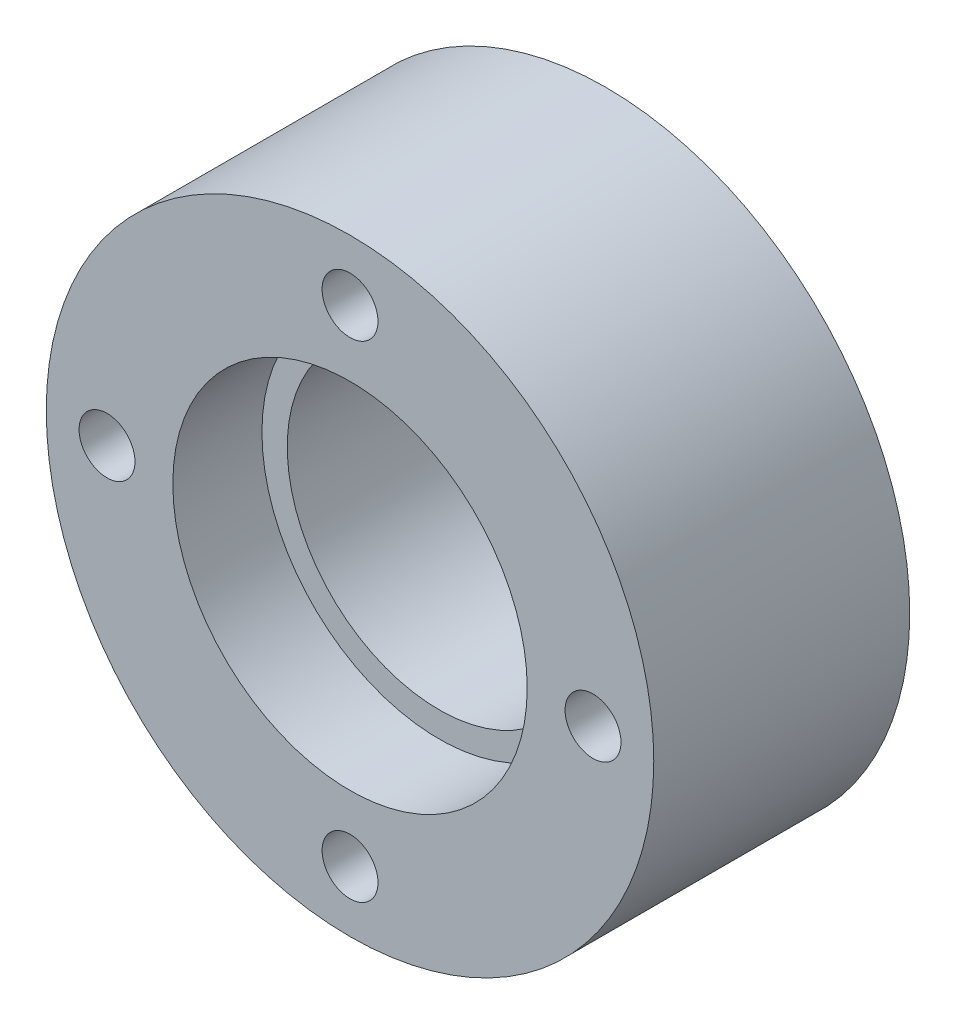
ISO-10303-21;
HEADER;
FILE_DESCRIPTION(('STEP AP214'),'2;1');
FILE_NAME('part.step','',(''),(''),'','','');
FILE_SCHEMA(('AUTOMOTIVE_DESIGN { 1 0 10303 214 1 1 1 1 }'));
ENDSEC;
DATA;
#1=APPLICATION_CONTEXT('core data for automotive mechanical design processes');
#2=APPLICATION_PROTOCOL_DEFINITION('international standard','automotive_design',2000,#1);
#3=PRODUCT_CONTEXT('',#1,'mechanical');
#4=PRODUCT('Part','Part','',(#3));
#5=PRODUCT_RELATED_PRODUCT_CATEGORY('part','',(#4));
#6=PRODUCT_DEFINITION_FORMATION('','',#4);
#7=PRODUCT_DEFINITION_CONTEXT('part definition',#1,'design');
#8=PRODUCT_DEFINITION('design','',#6,#7);
#9=PRODUCT_DEFINITION_SHAPE('','',#8);
#10=(LENGTH_UNIT() NAMED_UNIT(*) SI_UNIT(.MILLI.,.METRE.));
#11=(NAMED_UNIT(*) PLANE_ANGLE_UNIT() SI_UNIT($,.RADIAN.));
#12=(NAMED_UNIT(*) SI_UNIT($,.STERADIAN.) SOLID_ANGLE_UNIT());
#13=UNCERTAINTY_MEASURE_WITH_UNIT(LENGTH_MEASURE(1.E-05),#10,'distance_accuracy_value','');
#14=(GEOMETRIC_REPRESENTATION_CONTEXT(3) GLOBAL_UNCERTAINTY_ASSIGNED_CONTEXT((#13)) GLOBAL_UNIT_ASSIGNED_CONTEXT((#10,
#11,#12)) REPRESENTATION_CONTEXT('',''));
#15=CARTESIAN_POINT('',(0.,0.,0.));
#16=DIRECTION('',(0.,0.,1.));
#17=DIRECTION('',(1.,0.,0.));
#18=AXIS2_PLACEMENT_3D('',#15,#16,#17);
#19=CARTESIAN_POINT('',(0.,0.,16.0528));
#20=DIRECTION('',(0.,0.,-1.));
#21=DIRECTION('',(-1.,0.,0.));
#22=AXIS2_PLACEMENT_3D('',#19,#20,#21);
#23=CYLINDRICAL_SURFACE('',#22,9.525);
#24=CARTESIAN_POINT('',(0.,0.,0.));
#25=DIRECTION('',(0.,0.,1.));
#26=DIRECTION('',(1.,0.,0.));
#27=AXIS2_PLACEMENT_3D('',#24,#25,#26);
#28=CIRCLE('',#27,9.525);
#29=CARTESIAN_POINT('',(9.525,0.,0.));
#30=VERTEX_POINT('',#29);
#31=EDGE_CURVE('E49',#30,#30,#28,.T.);
#32=ORIENTED_EDGE('',*,*,#31,.F.);
#33=EDGE_LOOP('',(#32));
#34=FACE_BOUND('',#33,.T.);
#35=CARTESIAN_POINT('',(0.,0.,10.4648));
#36=DIRECTION('',(0.,0.,1.));
#37=DIRECTION('',(1.,0.,0.));
#38=AXIS2_PLACEMENT_3D('',#35,#36,#37);
#39=CIRCLE('',#38,9.525);
#40=CARTESIAN_POINT('',(9.525,0.,10.4648));
#41=VERTEX_POINT('',#40);
#42=EDGE_CURVE('E40',#41,#41,#39,.T.);
#43=ORIENTED_EDGE('',*,*,#42,.T.);
#44=EDGE_LOOP('',(#43));
#45=FACE_BOUND('',#44,.T.);
#46=ADVANCED_FACE('F36',(#34,#45),#23,.F.);
#47=CARTESIAN_POINT('',(0.,0.,16.0528));
#48=DIRECTION('',(0.,0.,1.));
#49=DIRECTION('',(1.,0.,0.));
#50=AXIS2_PLACEMENT_3D('',#47,#48,#49);
#51=PLANE('',#50);
#52=CARTESIAN_POINT('',(0.,0.,16.0528));
#53=DIRECTION('',(0.,0.,1.));
#54=DIRECTION('',(1.,0.,0.));
#55=AXIS2_PLACEMENT_3D('',#52,#53,#54);
#56=CIRCLE('',#55,11.1125);
#57=CARTESIAN_POINT('',(11.1125,0.,16.0528));
#58=VERTEX_POINT('',#57);
#59=EDGE_CURVE('E77',#58,#58,#56,.T.);
#60=ORIENTED_EDGE('',*,*,#59,.F.);
#61=EDGE_LOOP('',(#60));
#62=FACE_BOUND('',#61,.T.);
#63=CARTESIAN_POINT('',(3.72965547335014E-13,-15.2400000000006,16.0528));
#64=DIRECTION('',(0.,0.,1.));
#65=DIRECTION('',(1.,0.,0.));
#66=AXIS2_PLACEMENT_3D('',#63,#64,#65);
#67=CIRCLE('',#66,1.7526);
#68=CARTESIAN_POINT('',(1.75260000000037,-15.2400000000006,16.0528));
#69=VERTEX_POINT('',#68);
#70=EDGE_CURVE('E63',#69,#69,#67,.T.);
#71=ORIENTED_EDGE('',*,*,#70,.F.);
#72=EDGE_LOOP('',(#71));
#73=FACE_BOUND('',#72,.T.);
#74=CARTESIAN_POINT('',(0.,15.2399999999998,16.0528));
#75=DIRECTION('',(0.,0.,1.));
#76=DIRECTION('',(1.,0.,0.));
#77=AXIS2_PLACEMENT_3D('',#74,#75,#76);
#78=CIRCLE('',#77,1.7526);
#79=CARTESIAN_POINT('',(1.7526,15.2399999999998,16.0528));
#80=VERTEX_POINT('',#79);
#81=EDGE_CURVE('E53',#80,#80,#78,.T.);
#82=ORIENTED_EDGE('',*,*,#81,.F.);
#83=EDGE_LOOP('',(#82));
#84=FACE_BOUND('',#83,.T.);
#85=CARTESIAN_POINT('',(0.,0.,16.0528));
#86=DIRECTION('',(0.,0.,1.));
#87=DIRECTION('',(1.,0.,0.));
#88=AXIS2_PLACEMENT_3D('',#85,#86,#87);
#89=CIRCLE('',#88,19.05);
#90=CARTESIAN_POINT('',(19.05,0.,16.0528));
#91=VERTEX_POINT('',#90);
#92=EDGE_CURVE('E10',#91,#91,#89,.T.);
#93=ORIENTED_EDGE('',*,*,#92,.T.);
#94=EDGE_LOOP('',(#93));
#95=FACE_BOUND('',#94,.T.);
#96=CARTESIAN_POINT('',(15.2400000000004,-1.97758476261356E-13,16.0528));
#97=DIRECTION('',(0.,0.,1.));
#98=DIRECTION('',(1.,0.,0.));
#99=AXIS2_PLACEMENT_3D('',#96,#97,#98);
#100=CIRCLE('',#99,1.7526);
#101=CARTESIAN_POINT('',(16.9926000000004,-1.97758476261356E-13,16.0528));
#102=VERTEX_POINT('',#101);
#103=EDGE_CURVE('E57',#102,#102,#100,.T.);
#104=ORIENTED_EDGE('',*,*,#103,.F.);
#105=EDGE_LOOP('',(#104));
#106=FACE_BOUND('',#105,.T.);
#107=CARTESIAN_POINT('',(-15.24,-5.74193470548323E-13,16.0528));
#108=DIRECTION('',(0.,0.,1.));
#109=DIRECTION('',(1.,0.,0.));
#110=AXIS2_PLACEMENT_3D('',#107,#108,#109);
#111=CIRCLE('',#110,1.7526);
#112=CARTESIAN_POINT('',(-13.4874,-5.74193470548323E-13,16.0528));
#113=VERTEX_POINT('',#112);
#114=EDGE_CURVE('E69',#113,#113,#111,.T.);
#115=ORIENTED_EDGE('',*,*,#114,.F.);
#116=EDGE_LOOP('',(#115));
#117=FACE_BOUND('',#116,.T.);
#118=ADVANCED_FACE('F99',(#62,#73,#84,#95,#106,#117),#51,.T.);
#119=CARTESIAN_POINT('',(0.,0.,0.));
#120=DIRECTION('',(0.,0.,1.));
#121=DIRECTION('',(1.,0.,0.));
#122=AXIS2_PLACEMENT_3D('',#119,#120,#121);
#123=PLANE('',#122);
#124=CARTESIAN_POINT('',(0.,0.,0.));
#125=DIRECTION('',(0.,0.,1.));
#126=DIRECTION('',(1.,0.,0.));
#127=AXIS2_PLACEMENT_3D('',#124,#125,#126);
#128=CIRCLE('',#127,19.05);
#129=CARTESIAN_POINT('',(19.05,0.,0.));
#130=VERTEX_POINT('',#129);
#131=EDGE_CURVE('E44',#130,#130,#128,.T.);
#132=ORIENTED_EDGE('',*,*,#131,.F.);
#133=EDGE_LOOP('',(#132));
#134=FACE_BOUND('',#133,.T.);
#135=ORIENTED_EDGE('',*,*,#31,.T.);
#136=EDGE_LOOP('',(#135));
#137=FACE_BOUND('',#136,.T.);
#138=CARTESIAN_POINT('',(0.,15.2399999999998,0.));
#139=DIRECTION('',(0.,0.,1.));
#140=DIRECTION('',(1.,0.,0.));
#141=AXIS2_PLACEMENT_3D('',#138,#139,#140);
#142=CIRCLE('',#141,1.7526);
#143=CARTESIAN_POINT('',(1.7526,15.2399999999998,0.));
#144=VERTEX_POINT('',#143);
#145=EDGE_CURVE('E54',#144,#144,#142,.T.);
#146=ORIENTED_EDGE('',*,*,#145,.T.);
#147=EDGE_LOOP('',(#146));
#148=FACE_BOUND('',#147,.T.);
#149=CARTESIAN_POINT('',(15.2400000000004,-1.97758476261356E-13,0.));
#150=DIRECTION('',(0.,0.,1.));
#151=DIRECTION('',(1.,0.,0.));
#152=AXIS2_PLACEMENT_3D('',#149,#150,#151);
#153=CIRCLE('',#152,1.7526);
#154=CARTESIAN_POINT('',(16.9926000000004,-1.97758476261356E-13,0.));
#155=VERTEX_POINT('',#154);
#156=EDGE_CURVE('E60',#155,#155,#153,.T.);
#157=ORIENTED_EDGE('',*,*,#156,.T.);
#158=EDGE_LOOP('',(#157));
#159=FACE_BOUND('',#158,.T.);
#160=CARTESIAN_POINT('',(3.72965547335014E-13,-15.2400000000006,0.));
#161=DIRECTION('',(0.,0.,1.));
#162=DIRECTION('',(1.,0.,0.));
#163=AXIS2_PLACEMENT_3D('',#160,#161,#162);
#164=CIRCLE('',#163,1.7526);
#165=CARTESIAN_POINT('',(1.75260000000037,-15.2400000000006,0.));
#166=VERTEX_POINT('',#165);
#167=EDGE_CURVE('E66',#166,#166,#164,.T.);
#168=ORIENTED_EDGE('',*,*,#167,.T.);
#169=EDGE_LOOP('',(#168));
#170=FACE_BOUND('',#169,.T.);
#171=CARTESIAN_POINT('',(-15.24,-5.74193470548323E-13,0.));
#172=DIRECTION('',(0.,0.,1.));
#173=DIRECTION('',(1.,0.,0.));
#174=AXIS2_PLACEMENT_3D('',#171,#172,#173);
#175=CIRCLE('',#174,1.7526);
#176=CARTESIAN_POINT('',(-13.4874,-5.74193470548323E-13,0.));
#177=VERTEX_POINT('',#176);
#178=EDGE_CURVE('E72',#177,#177,#175,.T.);
#179=ORIENTED_EDGE('',*,*,#178,.T.);
#180=EDGE_LOOP('',(#179));
#181=FACE_BOUND('',#180,.T.);
#182=ADVANCED_FACE('F105',(#134,#137,#148,#159,#170,#181),#123,.F.);
#183=CARTESIAN_POINT('',(0.,0.,16.0528));
#184=DIRECTION('',(0.,0.,-1.));
#185=DIRECTION('',(-1.,0.,0.));
#186=AXIS2_PLACEMENT_3D('',#183,#184,#185);
#187=CYLINDRICAL_SURFACE('',#186,19.05);
#188=ORIENTED_EDGE('',*,*,#92,.F.);
#189=EDGE_LOOP('',(#188));
#190=FACE_BOUND('',#189,.T.);
#191=ORIENTED_EDGE('',*,*,#131,.T.);
#192=EDGE_LOOP('',(#191));
#193=FACE_BOUND('',#192,.T.);
#194=ADVANCED_FACE('F38',(#190,#193),#187,.T.);
#195=CARTESIAN_POINT('',(0.,15.2399999999998,16.0528));
#196=DIRECTION('',(0.,0.,-1.));
#197=DIRECTION('',(-1.,0.,0.));
#198=AXIS2_PLACEMENT_3D('',#195,#196,#197);
#199=CYLINDRICAL_SURFACE('',#198,1.7526);
#200=ORIENTED_EDGE('',*,*,#81,.T.);
#201=EDGE_LOOP('',(#200));
#202=FACE_BOUND('',#201,.T.);
#203=ORIENTED_EDGE('',*,*,#145,.F.);
#204=EDGE_LOOP('',(#203));
#205=FACE_BOUND('',#204,.T.);
#206=ADVANCED_FACE('F110',(#202,#205),#199,.F.);
#207=CARTESIAN_POINT('',(15.2400000000004,-1.97758476261356E-13,16.0528));
#208=DIRECTION('',(0.,0.,-1.));
#209=DIRECTION('',(-1.,0.,0.));
#210=AXIS2_PLACEMENT_3D('',#207,#208,#209);
#211=CYLINDRICAL_SURFACE('',#210,1.7526);
#212=ORIENTED_EDGE('',*,*,#103,.T.);
#213=EDGE_LOOP('',(#212));
#214=FACE_BOUND('',#213,.T.);
#215=ORIENTED_EDGE('',*,*,#156,.F.);
#216=EDGE_LOOP('',(#215));
#217=FACE_BOUND('',#216,.T.);
#218=ADVANCED_FACE('F136',(#214,#217),#211,.F.);
#219=CARTESIAN_POINT('',(3.72965547335014E-13,-15.2400000000006,16.0528));
#220=DIRECTION('',(0.,0.,-1.));
#221=DIRECTION('',(-1.,0.,0.));
#222=AXIS2_PLACEMENT_3D('',#219,#220,#221);
#223=CYLINDRICAL_SURFACE('',#222,1.7526);
#224=ORIENTED_EDGE('',*,*,#70,.T.);
#225=EDGE_LOOP('',(#224));
#226=FACE_BOUND('',#225,.T.);
#227=ORIENTED_EDGE('',*,*,#167,.F.);
#228=EDGE_LOOP('',(#227));
#229=FACE_BOUND('',#228,.T.);
#230=ADVANCED_FACE('F130',(#226,#229),#223,.F.);
#231=CARTESIAN_POINT('',(-15.24,-5.74193470548323E-13,16.0528));
#232=DIRECTION('',(0.,0.,-1.));
#233=DIRECTION('',(-1.,0.,0.));
#234=AXIS2_PLACEMENT_3D('',#231,#232,#233);
#235=CYLINDRICAL_SURFACE('',#234,1.7526);
#236=ORIENTED_EDGE('',*,*,#114,.T.);
#237=EDGE_LOOP('',(#236));
#238=FACE_BOUND('',#237,.T.);
#239=ORIENTED_EDGE('',*,*,#178,.F.);
#240=EDGE_LOOP('',(#239));
#241=FACE_BOUND('',#240,.T.);
#242=ADVANCED_FACE('F95',(#238,#241),#235,.F.);
#243=CARTESIAN_POINT('',(0.,0.,10.4648));
#244=DIRECTION('',(0.,0.,1.));
#245=DIRECTION('',(1.,0.,0.));
#246=AXIS2_PLACEMENT_3D('',#243,#244,#245);
#247=CYLINDRICAL_SURFACE('',#246,11.1125);
#248=CARTESIAN_POINT('',(0.,0.,10.4648));
#249=DIRECTION('',(0.,0.,1.));
#250=DIRECTION('',(1.,0.,0.));
#251=AXIS2_PLACEMENT_3D('',#248,#249,#250);
#252=CIRCLE('',#251,11.1125);
#253=CARTESIAN_POINT('',(11.1125,0.,10.4648));
#254=VERTEX_POINT('',#253);
#255=EDGE_CURVE('E80',#254,#254,#252,.T.);
#256=ORIENTED_EDGE('',*,*,#255,.F.);
#257=EDGE_LOOP('',(#256));
#258=FACE_BOUND('',#257,.T.);
#259=ORIENTED_EDGE('',*,*,#59,.T.);
#260=EDGE_LOOP('',(#259));
#261=FACE_BOUND('',#260,.T.);
#262=ADVANCED_FACE('F90',(#258,#261),#247,.F.);
#263=CARTESIAN_POINT('',(0.,0.,10.4648));
#264=DIRECTION('',(0.,0.,1.));
#265=DIRECTION('',(1.,0.,0.));
#266=AXIS2_PLACEMENT_3D('',#263,#264,#265);
#267=PLANE('',#266);
#268=ORIENTED_EDGE('',*,*,#42,.F.);
#269=EDGE_LOOP('',(#268));
#270=FACE_BOUND('',#269,.T.);
#271=ORIENTED_EDGE('',*,*,#255,.T.);
#272=EDGE_LOOP('',(#271));
#273=FACE_BOUND('',#272,.T.);
#274=ADVANCED_FACE('F88',(#270,#273),#267,.T.);
#275=CLOSED_SHELL('',(#46,#118,#182,#194,#206,#218,#230,#242,#262,#274));
#276=MANIFOLD_SOLID_BREP('B2',#275);
#277=ADVANCED_BREP_SHAPE_REPRESENTATION('',(#18,#276),#14);
#278=SHAPE_DEFINITION_REPRESENTATION(#9,#277);
ENDSEC;
END-ISO-10303-21;
